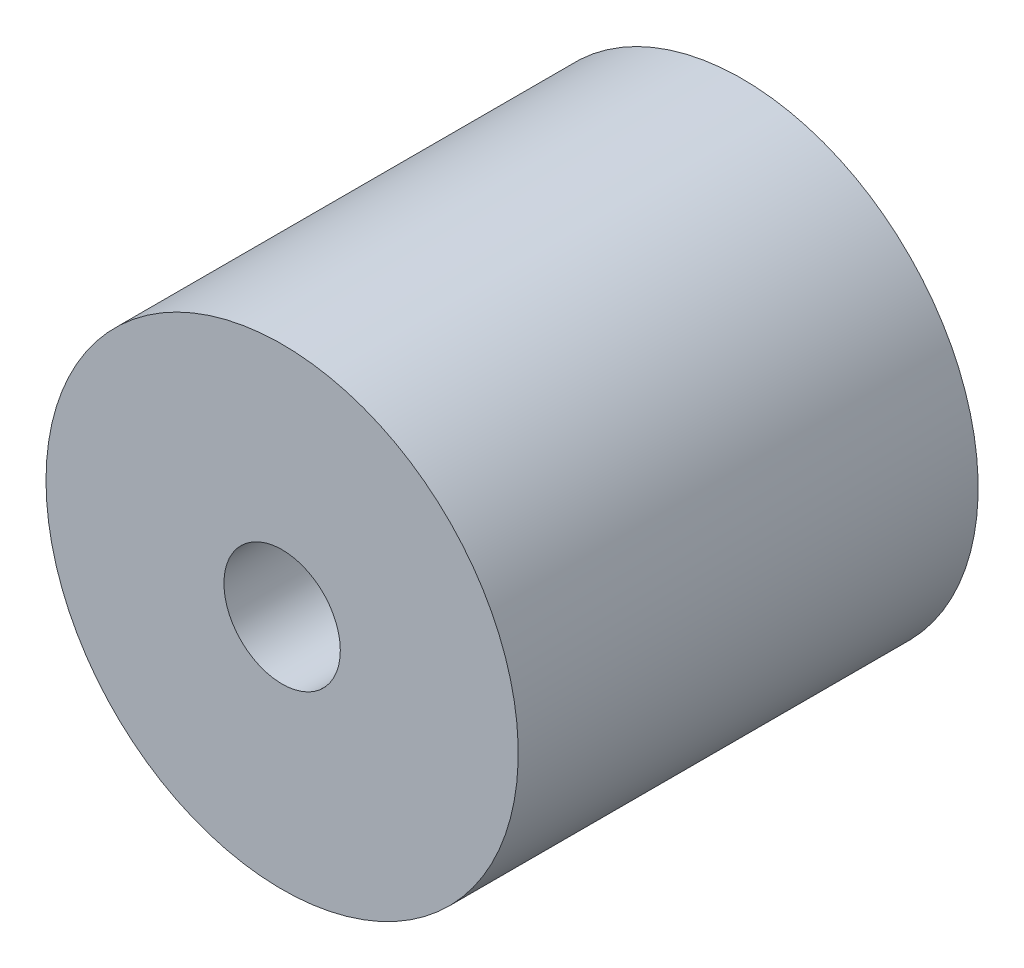
ISO-10303-21;
HEADER;
FILE_DESCRIPTION(('STEP AP214'),'2;1');
FILE_NAME('part.step','',(''),(''),'','','');
FILE_SCHEMA(('AUTOMOTIVE_DESIGN { 1 0 10303 214 1 1 1 1 }'));
ENDSEC;
DATA;
#1=APPLICATION_CONTEXT('core data for automotive mechanical design processes');
#2=APPLICATION_PROTOCOL_DEFINITION('international standard','automotive_design',2000,#1);
#3=PRODUCT_CONTEXT('',#1,'mechanical');
#4=PRODUCT('Part','Part','',(#3));
#5=PRODUCT_RELATED_PRODUCT_CATEGORY('part','',(#4));
#6=PRODUCT_DEFINITION_FORMATION('','',#4);
#7=PRODUCT_DEFINITION_CONTEXT('part definition',#1,'design');
#8=PRODUCT_DEFINITION('design','',#6,#7);
#9=PRODUCT_DEFINITION_SHAPE('','',#8);
#10=(LENGTH_UNIT() NAMED_UNIT(*) SI_UNIT(.MILLI.,.METRE.));
#11=(NAMED_UNIT(*) PLANE_ANGLE_UNIT() SI_UNIT($,.RADIAN.));
#12=(NAMED_UNIT(*) SI_UNIT($,.STERADIAN.) SOLID_ANGLE_UNIT());
#13=UNCERTAINTY_MEASURE_WITH_UNIT(LENGTH_MEASURE(1.E-05),#10,'distance_accuracy_value','');
#14=(GEOMETRIC_REPRESENTATION_CONTEXT(3) GLOBAL_UNCERTAINTY_ASSIGNED_CONTEXT((#13)) GLOBAL_UNIT_ASSIGNED_CONTEXT((#10,
#11,#12)) REPRESENTATION_CONTEXT('',''));
#15=CARTESIAN_POINT('',(0.,0.,0.));
#16=DIRECTION('',(0.,0.,1.));
#17=DIRECTION('',(1.,0.,0.));
#18=AXIS2_PLACEMENT_3D('',#15,#16,#17);
#19=CARTESIAN_POINT('',(0.,0.,-1.79705));
#20=DIRECTION('',(0.,0.,-1.));
#21=DIRECTION('',(-1.,0.,0.));
#22=AXIS2_PLACEMENT_3D('',#19,#20,#21);
#23=CYLINDRICAL_SURFACE('',#22,4.3815);
#24=CARTESIAN_POINT('',(0.,0.,-5.60705));
#25=DIRECTION('',(0.,0.,-1.));
#26=DIRECTION('',(-1.,0.,0.));
#27=AXIS2_PLACEMENT_3D('',#24,#25,#26);
#28=CIRCLE('',#27,4.3815);
#29=CARTESIAN_POINT('',(-4.3815,0.,-5.60705));
#30=VERTEX_POINT('',#29);
#31=EDGE_CURVE('E52',#30,#30,#28,.F.);
#32=ORIENTED_EDGE('',*,*,#31,.F.);
#33=EDGE_LOOP('',(#32));
#34=FACE_BOUND('',#33,.T.);
#35=CARTESIAN_POINT('',(0.,0.,-1.79705));
#36=DIRECTION('',(0.,0.,-1.));
#37=DIRECTION('',(-1.,0.,0.));
#38=AXIS2_PLACEMENT_3D('',#35,#36,#37);
#39=CIRCLE('',#38,4.3815);
#40=CARTESIAN_POINT('',(-4.3815,0.,-1.79705));
#41=VERTEX_POINT('',#40);
#42=EDGE_CURVE('E19',#41,#41,#39,.T.);
#43=ORIENTED_EDGE('',*,*,#42,.F.);
#44=EDGE_LOOP('',(#43));
#45=FACE_BOUND('',#44,.T.);
#46=ADVANCED_FACE('F16',(#34,#45),#23,.F.);
#47=CARTESIAN_POINT('',(0.,0.,-1.79705));
#48=DIRECTION('',(0.,0.,-1.));
#49=DIRECTION('',(-1.,0.,0.));
#50=AXIS2_PLACEMENT_3D('',#47,#48,#49);
#51=PLANE('',#50);
#52=ORIENTED_EDGE('',*,*,#42,.T.);
#53=EDGE_LOOP('',(#52));
#54=FACE_BOUND('',#53,.T.);
#55=CARTESIAN_POINT('',(0.,0.,-1.79705));
#56=DIRECTION('',(0.,0.,1.));
#57=DIRECTION('',(1.,0.,0.));
#58=AXIS2_PLACEMENT_3D('',#55,#56,#57);
#59=CIRCLE('',#58,2.2225);
#60=CARTESIAN_POINT('',(2.2225,0.,-1.79705));
#61=VERTEX_POINT('',#60);
#62=EDGE_CURVE('E46',#61,#61,#59,.T.);
#63=ORIENTED_EDGE('',*,*,#62,.T.);
#64=EDGE_LOOP('',(#63));
#65=FACE_BOUND('',#64,.T.);
#66=ADVANCED_FACE('F39',(#54,#65),#51,.T.);
#67=CARTESIAN_POINT('',(0.,6.985,0.737869999966279));
#68=DIRECTION('',(0.,0.,-1.));
#69=DIRECTION('',(0.,1.,0.));
#70=AXIS2_PLACEMENT_3D('',#67,#68,#69);
#71=CONICAL_SURFACE('',#70,1.20650000002342,1.08210413625789);
#72=CARTESIAN_POINT('',(0.,6.985,1.37794999994867));
#73=VERTEX_POINT('',#72);
#74=VERTEX_LOOP('',#73);
#75=FACE_BOUND('',#74,.T.);
#76=CARTESIAN_POINT('',(0.,6.985,0.737870000000002));
#77=DIRECTION('',(0.,0.,-1.));
#78=DIRECTION('',(-1.,0.,0.));
#79=AXIS2_PLACEMENT_3D('',#76,#77,#78);
#80=CIRCLE('',#79,1.2065);
#81=CARTESIAN_POINT('',(-1.2065,6.985,0.737870000000002));
#82=VERTEX_POINT('',#81);
#83=EDGE_CURVE('E43',#82,#82,#80,.T.);
#84=ORIENTED_EDGE('',*,*,#83,.T.);
#85=EDGE_LOOP('',(#84));
#86=FACE_BOUND('',#85,.T.);
#87=ADVANCED_FACE('F35',(#75,#86),#71,.F.);
#88=CARTESIAN_POINT('',(-6.04918744543432,-3.49249999999999,0.737870000023122));
#89=DIRECTION('',(0.,0.,-1.));
#90=DIRECTION('',(-1.,0.,0.));
#91=AXIS2_PLACEMENT_3D('',#88,#89,#90);
#92=CONICAL_SURFACE('',#91,1.20649999998784,1.08210413625789);
#93=CARTESIAN_POINT('',(-6.04918744542715,-3.49249999999999,1.37795000000551));
#94=VERTEX_POINT('',#93);
#95=VERTEX_LOOP('',#94);
#96=FACE_BOUND('',#95,.T.);
#97=CARTESIAN_POINT('',(-6.04918744543432,-3.49249999999999,0.737870000000006));
#98=DIRECTION('',(0.,0.,-1.));
#99=DIRECTION('',(-1.,0.,0.));
#100=AXIS2_PLACEMENT_3D('',#97,#98,#99);
#101=CIRCLE('',#100,1.2065);
#102=CARTESIAN_POINT('',(-7.25568744543431,-3.49249999999999,0.737870000000006));
#103=VERTEX_POINT('',#102);
#104=EDGE_CURVE('E45',#103,#103,#101,.T.);
#105=ORIENTED_EDGE('',*,*,#104,.T.);
#106=EDGE_LOOP('',(#105));
#107=FACE_BOUND('',#106,.T.);
#108=ADVANCED_FACE('F38',(#96,#107),#92,.F.);
#109=CARTESIAN_POINT('',(6.04918744543431,-3.49249999999999,0.737870000079965));
#110=DIRECTION('',(0.,0.,-1.));
#111=DIRECTION('',(-1.,0.,0.));
#112=AXIS2_PLACEMENT_3D('',#109,#110,#111);
#113=CONICAL_SURFACE('',#112,1.20649999988848,1.08210413623598);
#114=CARTESIAN_POINT('',(6.04918744542715,-3.49249999999999,1.37795000000551));
#115=VERTEX_POINT('',#114);
#116=VERTEX_LOOP('',#115);
#117=FACE_BOUND('',#116,.T.);
#118=CARTESIAN_POINT('',(6.04918744543431,-3.49249999999999,0.737870000000009));
#119=DIRECTION('',(0.,0.,-1.));
#120=DIRECTION('',(-1.,0.,0.));
#121=AXIS2_PLACEMENT_3D('',#118,#119,#120);
#122=CIRCLE('',#121,1.2065);
#123=CARTESIAN_POINT('',(4.84268744543431,-3.49249999999999,0.737870000000009));
#124=VERTEX_POINT('',#123);
#125=EDGE_CURVE('E49',#124,#124,#122,.T.);
#126=ORIENTED_EDGE('',*,*,#125,.T.);
#127=EDGE_LOOP('',(#126));
#128=FACE_BOUND('',#127,.T.);
#129=ADVANCED_FACE('F127',(#117,#128),#113,.F.);
#130=CARTESIAN_POINT('',(0.,0.,-5.60705));
#131=DIRECTION('',(0.,0.,-1.));
#132=DIRECTION('',(-1.,0.,0.));
#133=AXIS2_PLACEMENT_3D('',#130,#131,#132);
#134=PLANE('',#133);
#135=CARTESIAN_POINT('',(0.,0.,-5.60705));
#136=DIRECTION('',(0.,0.,-1.));
#137=DIRECTION('',(-1.,0.,0.));
#138=AXIS2_PLACEMENT_3D('',#135,#136,#137);
#139=CIRCLE('',#138,4.7625);
#140=CARTESIAN_POINT('',(-4.7625,0.,-5.60705));
#141=VERTEX_POINT('',#140);
#142=EDGE_CURVE('E73',#141,#141,#139,.T.);
#143=ORIENTED_EDGE('',*,*,#142,.T.);
#144=EDGE_LOOP('',(#143));
#145=FACE_BOUND('',#144,.T.);
#146=ORIENTED_EDGE('',*,*,#31,.T.);
#147=EDGE_LOOP('',(#146));
#148=FACE_BOUND('',#147,.T.);
#149=ADVANCED_FACE('F123',(#145,#148),#134,.T.);
#150=CARTESIAN_POINT('',(0.,0.,-8.78205));
#151=DIRECTION('',(0.,0.,1.));
#152=DIRECTION('',(1.,0.,0.));
#153=AXIS2_PLACEMENT_3D('',#150,#151,#152);
#154=CYLINDRICAL_SURFACE('',#153,2.2225);
#155=CARTESIAN_POINT('',(0.,0.,8.78205));
#156=DIRECTION('',(0.,0.,1.));
#157=DIRECTION('',(1.,0.,0.));
#158=AXIS2_PLACEMENT_3D('',#155,#156,#157);
#159=CIRCLE('',#158,2.2225);
#160=CARTESIAN_POINT('',(2.2225,0.,8.78205));
#161=VERTEX_POINT('',#160);
#162=EDGE_CURVE('E70',#161,#161,#159,.F.);
#163=ORIENTED_EDGE('',*,*,#162,.F.);
#164=EDGE_LOOP('',(#163));
#165=FACE_BOUND('',#164,.T.);
#166=ORIENTED_EDGE('',*,*,#62,.F.);
#167=EDGE_LOOP('',(#166));
#168=FACE_BOUND('',#167,.T.);
#169=ADVANCED_FACE('F120',(#165,#168),#154,.F.);
#170=CARTESIAN_POINT('',(0.,6.985,1.37795));
#171=DIRECTION('',(0.,0.,-1.));
#172=DIRECTION('',(-1.,0.,0.));
#173=AXIS2_PLACEMENT_3D('',#170,#171,#172);
#174=CYLINDRICAL_SURFACE('',#173,1.2065);
#175=ORIENTED_EDGE('',*,*,#83,.F.);
#176=EDGE_LOOP('',(#175));
#177=FACE_BOUND('',#176,.T.);
#178=CARTESIAN_POINT('',(0.,6.985,-8.78205));
#179=DIRECTION('',(0.,0.,-1.));
#180=DIRECTION('',(-1.,0.,0.));
#181=AXIS2_PLACEMENT_3D('',#178,#179,#180);
#182=CIRCLE('',#181,1.2065);
#183=CARTESIAN_POINT('',(-1.2065,6.985,-8.78205));
#184=VERTEX_POINT('',#183);
#185=EDGE_CURVE('E67',#184,#184,#182,.T.);
#186=ORIENTED_EDGE('',*,*,#185,.T.);
#187=EDGE_LOOP('',(#186));
#188=FACE_BOUND('',#187,.T.);
#189=ADVANCED_FACE('F116',(#177,#188),#174,.F.);
#190=CARTESIAN_POINT('',(-6.04918744543432,-3.49249999999999,1.37795));
#191=DIRECTION('',(0.,0.,-1.));
#192=DIRECTION('',(-1.,0.,0.));
#193=AXIS2_PLACEMENT_3D('',#190,#191,#192);
#194=CYLINDRICAL_SURFACE('',#193,1.2065);
#195=ORIENTED_EDGE('',*,*,#104,.F.);
#196=EDGE_LOOP('',(#195));
#197=FACE_BOUND('',#196,.T.);
#198=CARTESIAN_POINT('',(-6.04918744543432,-3.49249999999999,-8.78205));
#199=DIRECTION('',(0.,0.,-1.));
#200=DIRECTION('',(-1.,0.,0.));
#201=AXIS2_PLACEMENT_3D('',#198,#199,#200);
#202=CIRCLE('',#201,1.2065);
#203=CARTESIAN_POINT('',(-7.25568744543431,-3.49249999999999,-8.78205));
#204=VERTEX_POINT('',#203);
#205=EDGE_CURVE('E64',#204,#204,#202,.T.);
#206=ORIENTED_EDGE('',*,*,#205,.T.);
#207=EDGE_LOOP('',(#206));
#208=FACE_BOUND('',#207,.T.);
#209=ADVANCED_FACE('F112',(#197,#208),#194,.F.);
#210=CARTESIAN_POINT('',(6.04918744543431,-3.49249999999999,1.37795));
#211=DIRECTION('',(0.,0.,-1.));
#212=DIRECTION('',(-1.,0.,0.));
#213=AXIS2_PLACEMENT_3D('',#210,#211,#212);
#214=CYLINDRICAL_SURFACE('',#213,1.2065);
#215=ORIENTED_EDGE('',*,*,#125,.F.);
#216=EDGE_LOOP('',(#215));
#217=FACE_BOUND('',#216,.T.);
#218=CARTESIAN_POINT('',(6.04918744543431,-3.49249999999999,-8.78205));
#219=DIRECTION('',(0.,0.,-1.));
#220=DIRECTION('',(-1.,0.,0.));
#221=AXIS2_PLACEMENT_3D('',#218,#219,#220);
#222=CIRCLE('',#221,1.2065);
#223=CARTESIAN_POINT('',(4.84268744543431,-3.49249999999999,-8.78205));
#224=VERTEX_POINT('',#223);
#225=EDGE_CURVE('E61',#224,#224,#222,.T.);
#226=ORIENTED_EDGE('',*,*,#225,.T.);
#227=EDGE_LOOP('',(#226));
#228=FACE_BOUND('',#227,.T.);
#229=ADVANCED_FACE('F108',(#217,#228),#214,.F.);
#230=CARTESIAN_POINT('',(0.,0.,-5.60705));
#231=DIRECTION('',(0.,0.,-1.));
#232=DIRECTION('',(-1.,0.,0.));
#233=AXIS2_PLACEMENT_3D('',#230,#231,#232);
#234=CYLINDRICAL_SURFACE('',#233,4.7625);
#235=ORIENTED_EDGE('',*,*,#142,.F.);
#236=EDGE_LOOP('',(#235));
#237=FACE_BOUND('',#236,.T.);
#238=CARTESIAN_POINT('',(0.,0.,-8.78205));
#239=DIRECTION('',(0.,0.,-1.));
#240=DIRECTION('',(-1.,0.,0.));
#241=AXIS2_PLACEMENT_3D('',#238,#239,#240);
#242=CIRCLE('',#241,4.7625);
#243=CARTESIAN_POINT('',(-4.7625,0.,-8.78205));
#244=VERTEX_POINT('',#243);
#245=EDGE_CURVE('E58',#244,#244,#242,.T.);
#246=ORIENTED_EDGE('',*,*,#245,.T.);
#247=EDGE_LOOP('',(#246));
#248=FACE_BOUND('',#247,.T.);
#249=ADVANCED_FACE('F104',(#237,#248),#234,.F.);
#250=CARTESIAN_POINT('',(0.,0.,8.78205));
#251=DIRECTION('',(0.,0.,1.));
#252=DIRECTION('',(1.,0.,0.));
#253=AXIS2_PLACEMENT_3D('',#250,#251,#252);
#254=PLANE('',#253);
#255=CARTESIAN_POINT('',(0.,0.,8.78205));
#256=DIRECTION('',(0.,0.,-1.));
#257=DIRECTION('',(-1.,0.,0.));
#258=AXIS2_PLACEMENT_3D('',#255,#256,#257);
#259=CIRCLE('',#258,9.017);
#260=CARTESIAN_POINT('',(-9.017,0.,8.78205));
#261=VERTEX_POINT('',#260);
#262=EDGE_CURVE('E25',#261,#261,#259,.T.);
#263=ORIENTED_EDGE('',*,*,#262,.F.);
#264=EDGE_LOOP('',(#263));
#265=FACE_BOUND('',#264,.T.);
#266=ORIENTED_EDGE('',*,*,#162,.T.);
#267=EDGE_LOOP('',(#266));
#268=FACE_BOUND('',#267,.T.);
#269=ADVANCED_FACE('F97',(#265,#268),#254,.T.);
#270=CARTESIAN_POINT('',(0.,0.,-8.78205));
#271=DIRECTION('',(0.,0.,1.));
#272=DIRECTION('',(1.,0.,0.));
#273=AXIS2_PLACEMENT_3D('',#270,#271,#272);
#274=PLANE('',#273);
#275=CARTESIAN_POINT('',(0.,0.,-8.78205));
#276=DIRECTION('',(0.,0.,-1.));
#277=DIRECTION('',(-1.,0.,0.));
#278=AXIS2_PLACEMENT_3D('',#275,#276,#277);
#279=CIRCLE('',#278,9.017);
#280=CARTESIAN_POINT('',(-9.017,0.,-8.78205));
#281=VERTEX_POINT('',#280);
#282=EDGE_CURVE('E11',#281,#281,#279,.F.);
#283=ORIENTED_EDGE('',*,*,#282,.F.);
#284=EDGE_LOOP('',(#283));
#285=FACE_BOUND('',#284,.T.);
#286=ORIENTED_EDGE('',*,*,#245,.F.);
#287=EDGE_LOOP('',(#286));
#288=FACE_BOUND('',#287,.T.);
#289=ORIENTED_EDGE('',*,*,#225,.F.);
#290=EDGE_LOOP('',(#289));
#291=FACE_BOUND('',#290,.T.);
#292=ORIENTED_EDGE('',*,*,#205,.F.);
#293=EDGE_LOOP('',(#292));
#294=FACE_BOUND('',#293,.T.);
#295=ORIENTED_EDGE('',*,*,#185,.F.);
#296=EDGE_LOOP('',(#295));
#297=FACE_BOUND('',#296,.T.);
#298=ADVANCED_FACE('F91',(#285,#288,#291,#294,#297),#274,.F.);
#299=CARTESIAN_POINT('',(0.,0.,8.78205));
#300=DIRECTION('',(0.,0.,-1.));
#301=DIRECTION('',(-1.,0.,0.));
#302=AXIS2_PLACEMENT_3D('',#299,#300,#301);
#303=CYLINDRICAL_SURFACE('',#302,9.017);
#304=ORIENTED_EDGE('',*,*,#282,.T.);
#305=EDGE_LOOP('',(#304));
#306=FACE_BOUND('',#305,.T.);
#307=ORIENTED_EDGE('',*,*,#262,.T.);
#308=EDGE_LOOP('',(#307));
#309=FACE_BOUND('',#308,.T.);
#310=ADVANCED_FACE('F89',(#306,#309),#303,.T.);
#311=CLOSED_SHELL('',(#46,#66,#87,#108,#129,#149,#169,#189,#209,#229,#249,#269,#298,#310));
#312=MANIFOLD_SOLID_BREP('B1',#311);
#313=ADVANCED_BREP_SHAPE_REPRESENTATION('',(#18,#312),#14);
#314=SHAPE_DEFINITION_REPRESENTATION(#9,#313);
ENDSEC;
END-ISO-10303-21;
